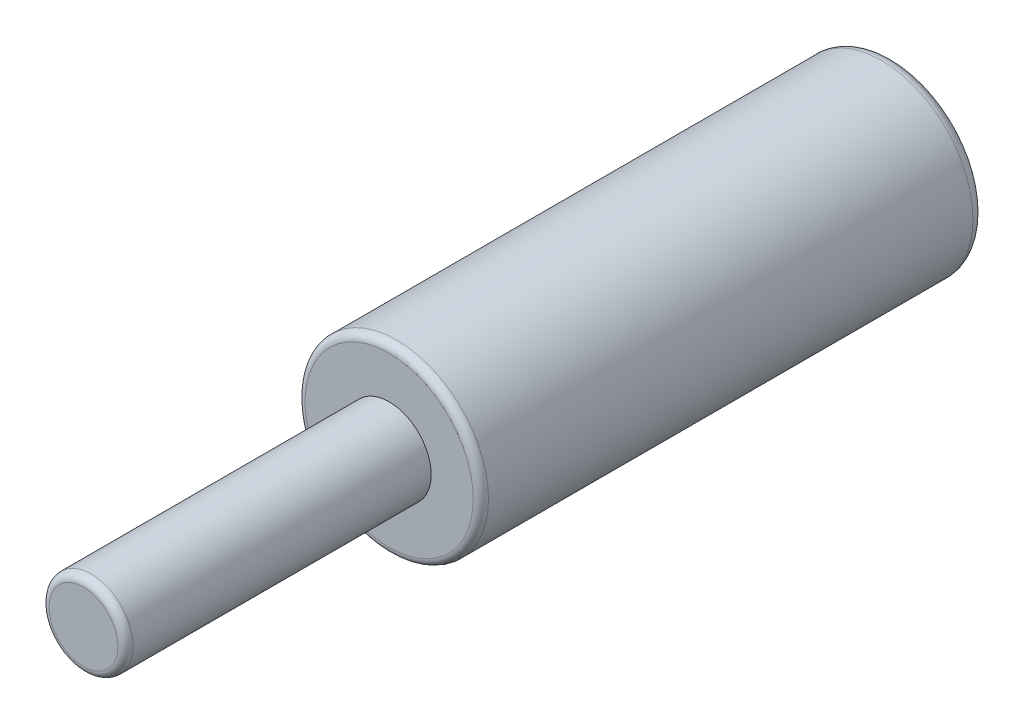
ISO-10303-21;
HEADER;
FILE_DESCRIPTION(('STEP AP214'),'2;1');
FILE_NAME('part.step','',(''),(''),'','','');
FILE_SCHEMA(('AUTOMOTIVE_DESIGN { 1 0 10303 214 1 1 1 1 }'));
ENDSEC;
DATA;
#1=APPLICATION_CONTEXT('core data for automotive mechanical design processes');
#2=APPLICATION_PROTOCOL_DEFINITION('international standard','automotive_design',2000,#1);
#3=PRODUCT_CONTEXT('',#1,'mechanical');
#4=PRODUCT('Part','Part','',(#3));
#5=PRODUCT_RELATED_PRODUCT_CATEGORY('part','',(#4));
#6=PRODUCT_DEFINITION_FORMATION('','',#4);
#7=PRODUCT_DEFINITION_CONTEXT('part definition',#1,'design');
#8=PRODUCT_DEFINITION('design','',#6,#7);
#9=PRODUCT_DEFINITION_SHAPE('','',#8);
#10=(LENGTH_UNIT() NAMED_UNIT(*) SI_UNIT(.MILLI.,.METRE.));
#11=(NAMED_UNIT(*) PLANE_ANGLE_UNIT() SI_UNIT($,.RADIAN.));
#12=(NAMED_UNIT(*) SI_UNIT($,.STERADIAN.) SOLID_ANGLE_UNIT());
#13=UNCERTAINTY_MEASURE_WITH_UNIT(LENGTH_MEASURE(1.E-05),#10,'distance_accuracy_value','');
#14=(GEOMETRIC_REPRESENTATION_CONTEXT(3) GLOBAL_UNCERTAINTY_ASSIGNED_CONTEXT((#13)) GLOBAL_UNIT_ASSIGNED_CONTEXT((#10,
#11,#12)) REPRESENTATION_CONTEXT('',''));
#15=CARTESIAN_POINT('',(0.,0.,0.));
#16=DIRECTION('',(0.,0.,1.));
#17=DIRECTION('',(1.,0.,0.));
#18=AXIS2_PLACEMENT_3D('',#15,#16,#17);
#19=CARTESIAN_POINT('',(0.,0.,0.));
#20=DIRECTION('',(0.,0.,1.));
#21=DIRECTION('',(1.,0.,0.));
#22=AXIS2_PLACEMENT_3D('',#19,#20,#21);
#23=PLANE('',#22);
#24=CARTESIAN_POINT('',(0.,0.,0.));
#25=DIRECTION('',(0.,0.,1.));
#26=DIRECTION('',(1.,0.,0.));
#27=AXIS2_PLACEMENT_3D('',#24,#25,#26);
#28=CIRCLE('',#27,5.2);
#29=CARTESIAN_POINT('',(5.2,0.,0.));
#30=VERTEX_POINT('',#29);
#31=EDGE_CURVE('E45',#30,#30,#28,.F.);
#32=ORIENTED_EDGE('',*,*,#31,.T.);
#33=EDGE_LOOP('',(#32));
#34=FACE_BOUND('',#33,.T.);
#35=CARTESIAN_POINT('',(0.,0.,0.));
#36=DIRECTION('',(0.,0.,1.));
#37=DIRECTION('',(1.,0.,0.));
#38=AXIS2_PLACEMENT_3D('',#35,#36,#37);
#39=CIRCLE('',#38,3.5);
#40=CARTESIAN_POINT('',(3.5,0.,0.));
#41=VERTEX_POINT('',#40);
#42=EDGE_CURVE('E60',#41,#41,#39,.T.);
#43=ORIENTED_EDGE('',*,*,#42,.T.);
#44=EDGE_LOOP('',(#43));
#45=FACE_BOUND('',#44,.T.);
#46=ADVANCED_FACE('F34',(#34,#45),#23,.F.);
#47=CARTESIAN_POINT('',(0.,0.,28.));
#48=DIRECTION('',(0.,0.,-1.));
#49=DIRECTION('',(-1.,0.,0.));
#50=AXIS2_PLACEMENT_3D('',#47,#48,#49);
#51=CYLINDRICAL_SURFACE('',#50,6.);
#52=CARTESIAN_POINT('',(0.,0.,0.799999999999999));
#53=DIRECTION('',(0.,0.,1.));
#54=DIRECTION('',(1.,0.,0.));
#55=AXIS2_PLACEMENT_3D('',#52,#53,#54);
#56=CIRCLE('',#55,6.);
#57=CARTESIAN_POINT('',(6.,0.,0.799999999999999));
#58=VERTEX_POINT('',#57);
#59=EDGE_CURVE('E49',#58,#58,#56,.T.);
#60=ORIENTED_EDGE('',*,*,#59,.T.);
#61=EDGE_LOOP('',(#60));
#62=FACE_BOUND('',#61,.T.);
#63=CARTESIAN_POINT('',(0.,0.,32.5));
#64=DIRECTION('',(0.,0.,1.));
#65=DIRECTION('',(1.,0.,0.));
#66=AXIS2_PLACEMENT_3D('',#63,#64,#65);
#67=CIRCLE('',#66,6.);
#68=CARTESIAN_POINT('',(6.,0.,32.5));
#69=VERTEX_POINT('',#68);
#70=EDGE_CURVE('E54',#69,#69,#67,.F.);
#71=ORIENTED_EDGE('',*,*,#70,.T.);
#72=EDGE_LOOP('',(#71));
#73=FACE_BOUND('',#72,.T.);
#74=ADVANCED_FACE('F87',(#62,#73),#51,.T.);
#75=CARTESIAN_POINT('',(0.,0.,28.));
#76=DIRECTION('',(0.,0.,-1.));
#77=DIRECTION('',(-1.,0.,0.));
#78=AXIS2_PLACEMENT_3D('',#75,#76,#77);
#79=CYLINDRICAL_SURFACE('',#78,3.5);
#80=CARTESIAN_POINT('',(0.,0.,28.));
#81=DIRECTION('',(0.,0.,1.));
#82=DIRECTION('',(1.,0.,0.));
#83=AXIS2_PLACEMENT_3D('',#80,#81,#82);
#84=CIRCLE('',#83,3.5);
#85=CARTESIAN_POINT('',(3.5,0.,28.));
#86=VERTEX_POINT('',#85);
#87=EDGE_CURVE('E63',#86,#86,#84,.T.);
#88=ORIENTED_EDGE('',*,*,#87,.T.);
#89=EDGE_LOOP('',(#88));
#90=FACE_BOUND('',#89,.T.);
#91=ORIENTED_EDGE('',*,*,#42,.F.);
#92=EDGE_LOOP('',(#91));
#93=FACE_BOUND('',#92,.T.);
#94=ADVANCED_FACE('F83',(#90,#93),#79,.F.);
#95=CARTESIAN_POINT('',(0.,0.,28.));
#96=DIRECTION('',(0.,0.,1.));
#97=DIRECTION('',(1.,0.,0.));
#98=AXIS2_PLACEMENT_3D('',#95,#96,#97);
#99=PLANE('',#98);
#100=ORIENTED_EDGE('',*,*,#87,.F.);
#101=EDGE_LOOP('',(#100));
#102=FACE_BOUND('',#101,.T.);
#103=ADVANCED_FACE('F74',(#102),#99,.F.);
#104=CARTESIAN_POINT('',(0.,0.,33.));
#105=DIRECTION('',(0.,0.,1.));
#106=DIRECTION('',(1.,0.,0.));
#107=AXIS2_PLACEMENT_3D('',#104,#105,#106);
#108=PLANE('',#107);
#109=CARTESIAN_POINT('',(0.,0.,33.));
#110=DIRECTION('',(0.,0.,1.));
#111=DIRECTION('',(1.,0.,0.));
#112=AXIS2_PLACEMENT_3D('',#109,#110,#111);
#113=CIRCLE('',#112,5.5);
#114=CARTESIAN_POINT('',(5.5,0.,33.));
#115=VERTEX_POINT('',#114);
#116=EDGE_CURVE('E57',#115,#115,#113,.T.);
#117=ORIENTED_EDGE('',*,*,#116,.T.);
#118=EDGE_LOOP('',(#117));
#119=FACE_BOUND('',#118,.T.);
#120=CARTESIAN_POINT('',(0.,0.,33.));
#121=DIRECTION('',(0.,0.,1.));
#122=DIRECTION('',(1.,0.,0.));
#123=AXIS2_PLACEMENT_3D('',#120,#121,#122);
#124=CIRCLE('',#123,2.75);
#125=CARTESIAN_POINT('',(2.75,0.,33.));
#126=VERTEX_POINT('',#125);
#127=EDGE_CURVE('E66',#126,#126,#124,.T.);
#128=ORIENTED_EDGE('',*,*,#127,.F.);
#129=EDGE_LOOP('',(#128));
#130=FACE_BOUND('',#129,.T.);
#131=ADVANCED_FACE('F72',(#119,#130),#108,.T.);
#132=CARTESIAN_POINT('',(0.,0.,53.));
#133=DIRECTION('',(0.,0.,-1.));
#134=DIRECTION('',(-1.,0.,0.));
#135=AXIS2_PLACEMENT_3D('',#132,#133,#134);
#136=CYLINDRICAL_SURFACE('',#135,2.75);
#137=CARTESIAN_POINT('',(0.,0.,52.5));
#138=DIRECTION('',(0.,0.,1.));
#139=DIRECTION('',(1.,0.,0.));
#140=AXIS2_PLACEMENT_3D('',#137,#138,#139);
#141=CIRCLE('',#140,2.75);
#142=CARTESIAN_POINT('',(2.75,0.,52.5));
#143=VERTEX_POINT('',#142);
#144=EDGE_CURVE('E10',#143,#143,#141,.F.);
#145=ORIENTED_EDGE('',*,*,#144,.T.);
#146=EDGE_LOOP('',(#145));
#147=FACE_BOUND('',#146,.T.);
#148=ORIENTED_EDGE('',*,*,#127,.T.);
#149=EDGE_LOOP('',(#148));
#150=FACE_BOUND('',#149,.T.);
#151=ADVANCED_FACE('F70',(#147,#150),#136,.T.);
#152=CARTESIAN_POINT('',(0.,0.,53.));
#153=DIRECTION('',(0.,0.,1.));
#154=DIRECTION('',(1.,0.,0.));
#155=AXIS2_PLACEMENT_3D('',#152,#153,#154);
#156=PLANE('',#155);
#157=CARTESIAN_POINT('',(0.,0.,53.));
#158=DIRECTION('',(0.,0.,1.));
#159=DIRECTION('',(1.,0.,0.));
#160=AXIS2_PLACEMENT_3D('',#157,#158,#159);
#161=CIRCLE('',#160,2.25);
#162=CARTESIAN_POINT('',(2.25,0.,53.));
#163=VERTEX_POINT('',#162);
#164=EDGE_CURVE('E41',#163,#163,#161,.T.);
#165=ORIENTED_EDGE('',*,*,#164,.T.);
#166=EDGE_LOOP('',(#165));
#167=FACE_BOUND('',#166,.T.);
#168=ADVANCED_FACE('F81',(#167),#156,.T.);
#169=CARTESIAN_POINT('',(0.,0.,32.5));
#170=DIRECTION('',(0.,0.,1.));
#171=DIRECTION('',(1.,0.,0.));
#172=AXIS2_PLACEMENT_3D('',#169,#170,#171);
#173=TOROIDAL_SURFACE('',#172,5.5,0.5);
#174=ORIENTED_EDGE('',*,*,#70,.F.);
#175=EDGE_LOOP('',(#174));
#176=FACE_BOUND('',#175,.T.);
#177=ORIENTED_EDGE('',*,*,#116,.F.);
#178=EDGE_LOOP('',(#177));
#179=FACE_BOUND('',#178,.T.);
#180=ADVANCED_FACE('F98',(#176,#179),#173,.T.);
#181=CARTESIAN_POINT('',(0.,0.,0.799999999999999));
#182=DIRECTION('',(0.,0.,1.));
#183=DIRECTION('',(1.,0.,0.));
#184=AXIS2_PLACEMENT_3D('',#181,#182,#183);
#185=TOROIDAL_SURFACE('',#184,5.2,0.8);
#186=ORIENTED_EDGE('',*,*,#31,.F.);
#187=EDGE_LOOP('',(#186));
#188=FACE_BOUND('',#187,.T.);
#189=ORIENTED_EDGE('',*,*,#59,.F.);
#190=EDGE_LOOP('',(#189));
#191=FACE_BOUND('',#190,.T.);
#192=ADVANCED_FACE('F100',(#188,#191),#185,.T.);
#193=CARTESIAN_POINT('',(0.,0.,52.5));
#194=DIRECTION('',(0.,0.,1.));
#195=DIRECTION('',(1.,0.,0.));
#196=AXIS2_PLACEMENT_3D('',#193,#194,#195);
#197=TOROIDAL_SURFACE('',#196,2.25,0.5);
#198=ORIENTED_EDGE('',*,*,#144,.F.);
#199=EDGE_LOOP('',(#198));
#200=FACE_BOUND('',#199,.T.);
#201=ORIENTED_EDGE('',*,*,#164,.F.);
#202=EDGE_LOOP('',(#201));
#203=FACE_BOUND('',#202,.T.);
#204=ADVANCED_FACE('F36',(#200,#203),#197,.T.);
#205=CLOSED_SHELL('',(#46,#74,#94,#103,#131,#151,#168,#180,#192,#204));
#206=MANIFOLD_SOLID_BREP('B2',#205);
#207=ADVANCED_BREP_SHAPE_REPRESENTATION('',(#18,#206),#14);
#208=SHAPE_DEFINITION_REPRESENTATION(#9,#207);
ENDSEC;
END-ISO-10303-21;
